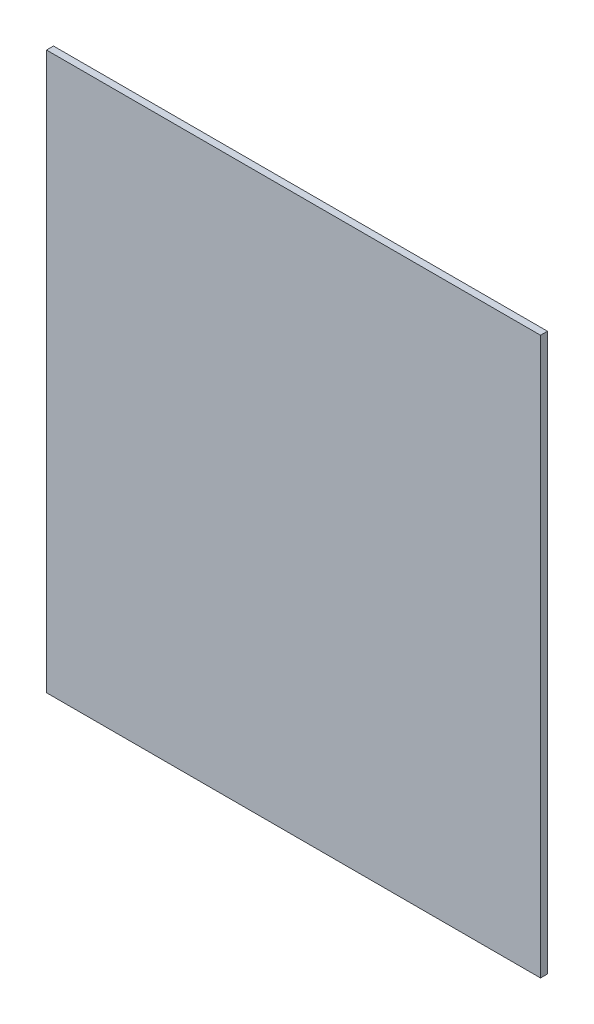
ISO-10303-21;
HEADER;
FILE_DESCRIPTION(('STEP AP214'),'2;1');
FILE_NAME('part.step','',(''),(''),'','','');
FILE_SCHEMA(('AUTOMOTIVE_DESIGN { 1 0 10303 214 1 1 1 1 }'));
ENDSEC;
DATA;
#1=APPLICATION_CONTEXT('core data for automotive mechanical design processes');
#2=APPLICATION_PROTOCOL_DEFINITION('international standard','automotive_design',2000,#1);
#3=PRODUCT_CONTEXT('',#1,'mechanical');
#4=PRODUCT('Part','Part','',(#3));
#5=PRODUCT_RELATED_PRODUCT_CATEGORY('part','',(#4));
#6=PRODUCT_DEFINITION_FORMATION('','',#4);
#7=PRODUCT_DEFINITION_CONTEXT('part definition',#1,'design');
#8=PRODUCT_DEFINITION('design','',#6,#7);
#9=PRODUCT_DEFINITION_SHAPE('','',#8);
#10=(LENGTH_UNIT() NAMED_UNIT(*) SI_UNIT(.MILLI.,.METRE.));
#11=(NAMED_UNIT(*) PLANE_ANGLE_UNIT() SI_UNIT($,.RADIAN.));
#12=(NAMED_UNIT(*) SI_UNIT($,.STERADIAN.) SOLID_ANGLE_UNIT());
#13=UNCERTAINTY_MEASURE_WITH_UNIT(LENGTH_MEASURE(1.E-05),#10,'distance_accuracy_value','');
#14=(GEOMETRIC_REPRESENTATION_CONTEXT(3) GLOBAL_UNCERTAINTY_ASSIGNED_CONTEXT((#13)) GLOBAL_UNIT_ASSIGNED_CONTEXT((#10,
#11,#12)) REPRESENTATION_CONTEXT('',''));
#15=CARTESIAN_POINT('',(0.,0.,0.));
#16=DIRECTION('',(0.,0.,1.));
#17=DIRECTION('',(1.,0.,0.));
#18=AXIS2_PLACEMENT_3D('',#15,#16,#17);
#19=CARTESIAN_POINT('',(1.270000012757E-06,0.,0.01999996));
#20=DIRECTION('',(0.,0.,1.));
#21=DIRECTION('',(1.,0.,0.));
#22=AXIS2_PLACEMENT_3D('',#19,#20,#21);
#23=PLANE('',#22);
#24=DIRECTION('',(0.,1.,0.));
#25=VECTOR('',#24,1.);
#26=CARTESIAN_POINT('',(0.71000112,-0.80000094,0.01999996));
#27=LINE('',#26,#25);
#28=CARTESIAN_POINT('',(0.71000112,-0.80000094,0.01999996));
#29=VERTEX_POINT('',#28);
#30=CARTESIAN_POINT('',(0.71000112,0.80000094,0.01999996));
#31=VERTEX_POINT('',#30);
#32=EDGE_CURVE('E99',#29,#31,#27,.T.);
#33=ORIENTED_EDGE('',*,*,#32,.T.);
#34=DIRECTION('',(-1.,0.,0.));
#35=VECTOR('',#34,1.);
#36=CARTESIAN_POINT('',(0.71000112,0.80000094,0.01999996));
#37=LINE('',#36,#35);
#38=CARTESIAN_POINT('',(-0.70999858,0.80000094,0.01999996));
#39=VERTEX_POINT('',#38);
#40=EDGE_CURVE('E65',#31,#39,#37,.T.);
#41=ORIENTED_EDGE('',*,*,#40,.T.);
#42=DIRECTION('',(0.,-1.,0.));
#43=VECTOR('',#42,1.);
#44=CARTESIAN_POINT('',(-0.70999858,0.80000094,0.01999996));
#45=LINE('',#44,#43);
#46=CARTESIAN_POINT('',(-0.70999858,-0.80000094,0.01999996));
#47=VERTEX_POINT('',#46);
#48=EDGE_CURVE('E88',#39,#47,#45,.T.);
#49=ORIENTED_EDGE('',*,*,#48,.T.);
#50=DIRECTION('',(1.,0.,0.));
#51=VECTOR('',#50,1.);
#52=CARTESIAN_POINT('',(-0.70999858,-0.80000094,0.01999996));
#53=LINE('',#52,#51);
#54=EDGE_CURVE('E11',#47,#29,#53,.T.);
#55=ORIENTED_EDGE('',*,*,#54,.T.);
#56=EDGE_LOOP('',(#33,#41,#49,#55));
#57=FACE_BOUND('',#56,.T.);
#58=ADVANCED_FACE('F16',(#57),#23,.T.);
#59=CARTESIAN_POINT('',(1.270000012757E-06,0.,0.));
#60=DIRECTION('',(0.,0.,1.));
#61=DIRECTION('',(1.,0.,0.));
#62=AXIS2_PLACEMENT_3D('',#59,#60,#61);
#63=PLANE('',#62);
#64=DIRECTION('',(0.,1.,0.));
#65=VECTOR('',#64,1.);
#66=CARTESIAN_POINT('',(0.71000112,-0.80000094,0.));
#67=LINE('',#66,#65);
#68=CARTESIAN_POINT('',(0.71000112,-0.80000094,0.));
#69=VERTEX_POINT('',#68);
#70=CARTESIAN_POINT('',(0.71000112,0.80000094,0.));
#71=VERTEX_POINT('',#70);
#72=EDGE_CURVE('E91',#69,#71,#67,.T.);
#73=ORIENTED_EDGE('',*,*,#72,.F.);
#74=DIRECTION('',(1.,0.,0.));
#75=VECTOR('',#74,1.);
#76=CARTESIAN_POINT('',(-0.70999858,-0.80000094,0.));
#77=LINE('',#76,#75);
#78=CARTESIAN_POINT('',(-0.70999858,-0.80000094,0.));
#79=VERTEX_POINT('',#78);
#80=EDGE_CURVE('E26',#79,#69,#77,.T.);
#81=ORIENTED_EDGE('',*,*,#80,.F.);
#82=DIRECTION('',(0.,-1.,0.));
#83=VECTOR('',#82,1.);
#84=CARTESIAN_POINT('',(-0.70999858,0.80000094,0.));
#85=LINE('',#84,#83);
#86=CARTESIAN_POINT('',(-0.70999858,0.80000094,0.));
#87=VERTEX_POINT('',#86);
#88=EDGE_CURVE('E52',#87,#79,#85,.T.);
#89=ORIENTED_EDGE('',*,*,#88,.F.);
#90=DIRECTION('',(-1.,0.,0.));
#91=VECTOR('',#90,1.);
#92=CARTESIAN_POINT('',(0.71000112,0.80000094,0.));
#93=LINE('',#92,#91);
#94=EDGE_CURVE('E74',#71,#87,#93,.T.);
#95=ORIENTED_EDGE('',*,*,#94,.F.);
#96=EDGE_LOOP('',(#73,#81,#89,#95));
#97=FACE_BOUND('',#96,.T.);
#98=ADVANCED_FACE('F92',(#97),#63,.F.);
#99=CARTESIAN_POINT('',(-0.70999858,-0.80000094,0.));
#100=DIRECTION('',(0.,1.,0.));
#101=DIRECTION('',(1.,0.,0.));
#102=AXIS2_PLACEMENT_3D('',#99,#100,#101);
#103=PLANE('',#102);
#104=DIRECTION('',(0.,0.,1.));
#105=VECTOR('',#104,1.);
#106=CARTESIAN_POINT('',(-0.70999858,-0.80000094,0.));
#107=LINE('',#106,#105);
#108=EDGE_CURVE('E86',#79,#47,#107,.T.);
#109=ORIENTED_EDGE('',*,*,#108,.F.);
#110=ORIENTED_EDGE('',*,*,#80,.T.);
#111=DIRECTION('',(0.,0.,1.));
#112=VECTOR('',#111,1.);
#113=CARTESIAN_POINT('',(0.71000112,-0.80000094,0.));
#114=LINE('',#113,#112);
#115=EDGE_CURVE('E84',#69,#29,#114,.T.);
#116=ORIENTED_EDGE('',*,*,#115,.T.);
#117=ORIENTED_EDGE('',*,*,#54,.F.);
#118=EDGE_LOOP('',(#109,#110,#116,#117));
#119=FACE_BOUND('',#118,.T.);
#120=ADVANCED_FACE('F82',(#119),#103,.F.);
#121=CARTESIAN_POINT('',(-0.70999858,0.80000094,0.));
#122=DIRECTION('',(1.,0.,0.));
#123=DIRECTION('',(0.,1.,0.));
#124=AXIS2_PLACEMENT_3D('',#121,#122,#123);
#125=PLANE('',#124);
#126=DIRECTION('',(0.,0.,1.));
#127=VECTOR('',#126,1.);
#128=CARTESIAN_POINT('',(-0.70999858,0.80000094,0.));
#129=LINE('',#128,#127);
#130=EDGE_CURVE('E113',#87,#39,#129,.T.);
#131=ORIENTED_EDGE('',*,*,#130,.F.);
#132=ORIENTED_EDGE('',*,*,#88,.T.);
#133=ORIENTED_EDGE('',*,*,#108,.T.);
#134=ORIENTED_EDGE('',*,*,#48,.F.);
#135=EDGE_LOOP('',(#131,#132,#133,#134));
#136=FACE_BOUND('',#135,.T.);
#137=ADVANCED_FACE('F120',(#136),#125,.F.);
#138=CARTESIAN_POINT('',(0.71000112,0.80000094,0.));
#139=DIRECTION('',(0.,-1.,0.));
#140=DIRECTION('',(0.,0.,-1.));
#141=AXIS2_PLACEMENT_3D('',#138,#139,#140);
#142=PLANE('',#141);
#143=DIRECTION('',(0.,0.,1.));
#144=VECTOR('',#143,1.);
#145=CARTESIAN_POINT('',(0.71000112,0.80000094,0.));
#146=LINE('',#145,#144);
#147=EDGE_CURVE('E96',#71,#31,#146,.T.);
#148=ORIENTED_EDGE('',*,*,#147,.F.);
#149=ORIENTED_EDGE('',*,*,#94,.T.);
#150=ORIENTED_EDGE('',*,*,#130,.T.);
#151=ORIENTED_EDGE('',*,*,#40,.F.);
#152=EDGE_LOOP('',(#148,#149,#150,#151));
#153=FACE_BOUND('',#152,.T.);
#154=ADVANCED_FACE('F18',(#153),#142,.F.);
#155=CARTESIAN_POINT('',(0.71000112,-0.80000094,0.));
#156=DIRECTION('',(-1.,0.,0.));
#157=DIRECTION('',(0.,0.,1.));
#158=AXIS2_PLACEMENT_3D('',#155,#156,#157);
#159=PLANE('',#158);
#160=ORIENTED_EDGE('',*,*,#115,.F.);
#161=ORIENTED_EDGE('',*,*,#72,.T.);
#162=ORIENTED_EDGE('',*,*,#147,.T.);
#163=ORIENTED_EDGE('',*,*,#32,.F.);
#164=EDGE_LOOP('',(#160,#161,#162,#163));
#165=FACE_BOUND('',#164,.T.);
#166=ADVANCED_FACE('F98',(#165),#159,.F.);
#167=CLOSED_SHELL('',(#58,#98,#120,#137,#154,#166));
#168=MANIFOLD_SOLID_BREP('B1',#167);
#169=ADVANCED_BREP_SHAPE_REPRESENTATION('',(#18,#168),#14);
#170=SHAPE_DEFINITION_REPRESENTATION(#9,#169);
ENDSEC;
END-ISO-10303-21;
